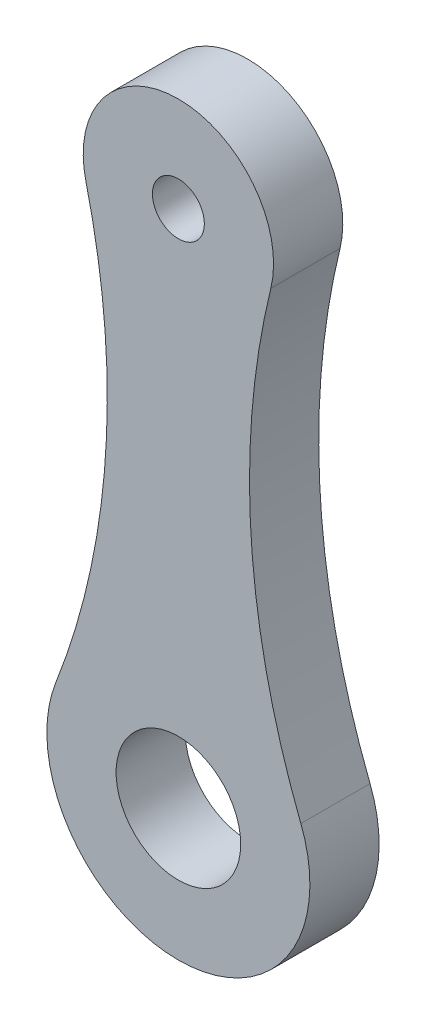
ISO-10303-21;
HEADER;
FILE_DESCRIPTION(('STEP AP214'),'2;1');
FILE_NAME('part.step','',(''),(''),'','','');
FILE_SCHEMA(('AUTOMOTIVE_DESIGN { 1 0 10303 214 1 1 1 1 }'));
ENDSEC;
DATA;
#1=APPLICATION_CONTEXT('core data for automotive mechanical design processes');
#2=APPLICATION_PROTOCOL_DEFINITION('international standard','automotive_design',2000,#1);
#3=PRODUCT_CONTEXT('',#1,'mechanical');
#4=PRODUCT('Part','Part','',(#3));
#5=PRODUCT_RELATED_PRODUCT_CATEGORY('part','',(#4));
#6=PRODUCT_DEFINITION_FORMATION('','',#4);
#7=PRODUCT_DEFINITION_CONTEXT('part definition',#1,'design');
#8=PRODUCT_DEFINITION('design','',#6,#7);
#9=PRODUCT_DEFINITION_SHAPE('','',#8);
#10=(LENGTH_UNIT() NAMED_UNIT(*) SI_UNIT(.MILLI.,.METRE.));
#11=(NAMED_UNIT(*) PLANE_ANGLE_UNIT() SI_UNIT($,.RADIAN.));
#12=(NAMED_UNIT(*) SI_UNIT($,.STERADIAN.) SOLID_ANGLE_UNIT());
#13=UNCERTAINTY_MEASURE_WITH_UNIT(LENGTH_MEASURE(1.E-05),#10,'distance_accuracy_value','');
#14=(GEOMETRIC_REPRESENTATION_CONTEXT(3) GLOBAL_UNCERTAINTY_ASSIGNED_CONTEXT((#13)) GLOBAL_UNIT_ASSIGNED_CONTEXT((#10,
#11,#12)) REPRESENTATION_CONTEXT('',''));
#15=CARTESIAN_POINT('',(0.,0.,0.));
#16=DIRECTION('',(0.,0.,1.));
#17=DIRECTION('',(1.,0.,0.));
#18=AXIS2_PLACEMENT_3D('',#15,#16,#17);
#19=CARTESIAN_POINT('',(47.1242404305022,3.46950748520222,4.));
#20=DIRECTION('',(0.,0.,-1.));
#21=DIRECTION('',(-1.,0.,0.));
#22=AXIS2_PLACEMENT_3D('',#19,#20,#21);
#23=CYLINDRICAL_SURFACE('',#22,43.0143926457458);
#24=CARTESIAN_POINT('',(47.1242404305022,3.46950748520222,0.));
#25=DIRECTION('',(0.,0.,1.));
#26=DIRECTION('',(1.,0.,0.));
#27=AXIS2_PLACEMENT_3D('',#24,#25,#26);
#28=CIRCLE('',#27,43.0143926457458);
#29=CARTESIAN_POINT('',(5.34240064098773,13.6928062916408,0.));
#30=VERTEX_POINT('',#29);
#31=CARTESIAN_POINT('',(7.07593647875019,-12.2267126097909,0.));
#32=VERTEX_POINT('',#31);
#33=EDGE_CURVE('E121',#30,#32,#28,.T.);
#34=ORIENTED_EDGE('',*,*,#33,.F.);
#35=DIRECTION('',(0.,0.,-1.));
#36=VECTOR('',#35,1.);
#37=CARTESIAN_POINT('',(5.34240064098773,13.6928062916408,4.));
#38=LINE('',#37,#36);
#39=CARTESIAN_POINT('',(5.34240064098773,13.6928062916408,4.));
#40=VERTEX_POINT('',#39);
#41=EDGE_CURVE('E11',#40,#30,#38,.T.);
#42=ORIENTED_EDGE('',*,*,#41,.F.);
#43=CARTESIAN_POINT('',(47.1242404305022,3.46950748520222,4.));
#44=DIRECTION('',(0.,0.,1.));
#45=DIRECTION('',(1.,0.,0.));
#46=AXIS2_PLACEMENT_3D('',#43,#44,#45);
#47=CIRCLE('',#46,43.0143926457458);
#48=CARTESIAN_POINT('',(7.07593647875019,-12.2267126097909,4.));
#49=VERTEX_POINT('',#48);
#50=EDGE_CURVE('E97',#40,#49,#47,.T.);
#51=ORIENTED_EDGE('',*,*,#50,.T.);
#52=DIRECTION('',(0.,0.,-1.));
#53=VECTOR('',#52,1.);
#54=CARTESIAN_POINT('',(7.07593647875019,-12.2267126097909,4.));
#55=LINE('',#54,#53);
#56=EDGE_CURVE('E85',#49,#32,#55,.T.);
#57=ORIENTED_EDGE('',*,*,#56,.T.);
#58=EDGE_LOOP('',(#34,#42,#51,#57));
#59=FACE_BOUND('',#58,.T.);
#60=ADVANCED_FACE('F45',(#59),#23,.F.);
#61=CARTESIAN_POINT('',(0.,15.,4.));
#62=DIRECTION('',(0.,0.,-1.));
#63=DIRECTION('',(-1.,0.,0.));
#64=AXIS2_PLACEMENT_3D('',#61,#62,#63);
#65=CYLINDRICAL_SURFACE('',#64,5.5);
#66=CARTESIAN_POINT('',(0.,15.,0.));
#67=DIRECTION('',(0.,0.,1.));
#68=DIRECTION('',(1.,0.,0.));
#69=AXIS2_PLACEMENT_3D('',#66,#67,#68);
#70=CIRCLE('',#69,5.5);
#71=CARTESIAN_POINT('',(-5.34240064098772,13.6928062916408,0.));
#72=VERTEX_POINT('',#71);
#73=EDGE_CURVE('E103',#30,#72,#70,.T.);
#74=ORIENTED_EDGE('',*,*,#73,.T.);
#75=DIRECTION('',(0.,0.,-1.));
#76=VECTOR('',#75,1.);
#77=CARTESIAN_POINT('',(-5.34240064098772,13.6928062916408,4.));
#78=LINE('',#77,#76);
#79=CARTESIAN_POINT('',(-5.34240064098772,13.6928062916408,4.));
#80=VERTEX_POINT('',#79);
#81=EDGE_CURVE('E54',#80,#72,#78,.T.);
#82=ORIENTED_EDGE('',*,*,#81,.F.);
#83=CARTESIAN_POINT('',(0.,15.,4.));
#84=DIRECTION('',(0.,0.,1.));
#85=DIRECTION('',(1.,0.,0.));
#86=AXIS2_PLACEMENT_3D('',#83,#84,#85);
#87=CIRCLE('',#86,5.5);
#88=EDGE_CURVE('E91',#40,#80,#87,.T.);
#89=ORIENTED_EDGE('',*,*,#88,.F.);
#90=ORIENTED_EDGE('',*,*,#41,.T.);
#91=EDGE_LOOP('',(#74,#82,#89,#90));
#92=FACE_BOUND('',#91,.T.);
#93=ADVANCED_FACE('F101',(#92),#65,.T.);
#94=CARTESIAN_POINT('',(-47.1242404305022,3.46950748520221,4.));
#95=DIRECTION('',(0.,0.,-1.));
#96=DIRECTION('',(-1.,0.,0.));
#97=AXIS2_PLACEMENT_3D('',#94,#95,#96);
#98=CYLINDRICAL_SURFACE('',#97,43.0143926457458);
#99=CARTESIAN_POINT('',(-47.1242404305022,3.46950748520221,0.));
#100=DIRECTION('',(0.,0.,1.));
#101=DIRECTION('',(1.,0.,0.));
#102=AXIS2_PLACEMENT_3D('',#99,#100,#101);
#103=CIRCLE('',#102,43.0143926457458);
#104=CARTESIAN_POINT('',(-7.07593647875018,-12.2267126097909,0.));
#105=VERTEX_POINT('',#104);
#106=EDGE_CURVE('E78',#72,#105,#103,.F.);
#107=ORIENTED_EDGE('',*,*,#106,.T.);
#108=DIRECTION('',(0.,0.,-1.));
#109=VECTOR('',#108,1.);
#110=CARTESIAN_POINT('',(-7.07593647875018,-12.2267126097909,4.));
#111=LINE('',#110,#109);
#112=CARTESIAN_POINT('',(-7.07593647875018,-12.2267126097909,4.));
#113=VERTEX_POINT('',#112);
#114=EDGE_CURVE('E105',#113,#105,#111,.T.);
#115=ORIENTED_EDGE('',*,*,#114,.F.);
#116=CARTESIAN_POINT('',(-47.1242404305022,3.46950748520221,4.));
#117=DIRECTION('',(0.,0.,1.));
#118=DIRECTION('',(1.,0.,0.));
#119=AXIS2_PLACEMENT_3D('',#116,#117,#118);
#120=CIRCLE('',#119,43.0143926457458);
#121=EDGE_CURVE('E96',#80,#113,#120,.F.);
#122=ORIENTED_EDGE('',*,*,#121,.F.);
#123=ORIENTED_EDGE('',*,*,#81,.T.);
#124=EDGE_LOOP('',(#107,#115,#122,#123));
#125=FACE_BOUND('',#124,.T.);
#126=ADVANCED_FACE('F106',(#125),#98,.F.);
#127=CARTESIAN_POINT('',(0.,15.,4.));
#128=DIRECTION('',(0.,0.,-1.));
#129=DIRECTION('',(-1.,0.,0.));
#130=AXIS2_PLACEMENT_3D('',#127,#128,#129);
#131=CYLINDRICAL_SURFACE('',#130,1.5);
#132=CARTESIAN_POINT('',(0.,15.,4.));
#133=DIRECTION('',(0.,0.,1.));
#134=DIRECTION('',(1.,0.,0.));
#135=AXIS2_PLACEMENT_3D('',#132,#133,#134);
#136=CIRCLE('',#135,1.5);
#137=CARTESIAN_POINT('',(1.50000000000001,15.,4.));
#138=VERTEX_POINT('',#137);
#139=EDGE_CURVE('E110',#138,#138,#136,.T.);
#140=ORIENTED_EDGE('',*,*,#139,.T.);
#141=EDGE_LOOP('',(#140));
#142=FACE_BOUND('',#141,.T.);
#143=CARTESIAN_POINT('',(0.,15.,0.));
#144=DIRECTION('',(0.,0.,1.));
#145=DIRECTION('',(1.,0.,0.));
#146=AXIS2_PLACEMENT_3D('',#143,#144,#145);
#147=CIRCLE('',#146,1.5);
#148=CARTESIAN_POINT('',(1.50000000000001,15.,0.));
#149=VERTEX_POINT('',#148);
#150=EDGE_CURVE('E132',#149,#149,#147,.T.);
#151=ORIENTED_EDGE('',*,*,#150,.F.);
#152=EDGE_LOOP('',(#151));
#153=FACE_BOUND('',#152,.T.);
#154=ADVANCED_FACE('F156',(#142,#153),#131,.F.);
#155=CARTESIAN_POINT('',(0.,-15.,4.));
#156=DIRECTION('',(0.,0.,-1.));
#157=DIRECTION('',(-1.,0.,0.));
#158=AXIS2_PLACEMENT_3D('',#155,#156,#157);
#159=CYLINDRICAL_SURFACE('',#158,7.60000000000001);
#160=CARTESIAN_POINT('',(0.,-15.,0.));
#161=DIRECTION('',(0.,0.,1.));
#162=DIRECTION('',(1.,0.,0.));
#163=AXIS2_PLACEMENT_3D('',#160,#161,#162);
#164=CIRCLE('',#163,7.60000000000001);
#165=EDGE_CURVE('E129',#105,#32,#164,.T.);
#166=ORIENTED_EDGE('',*,*,#165,.T.);
#167=ORIENTED_EDGE('',*,*,#56,.F.);
#168=CARTESIAN_POINT('',(0.,-15.,4.));
#169=DIRECTION('',(0.,0.,1.));
#170=DIRECTION('',(1.,0.,0.));
#171=AXIS2_PLACEMENT_3D('',#168,#169,#170);
#172=CIRCLE('',#171,7.60000000000001);
#173=EDGE_CURVE('E62',#113,#49,#172,.T.);
#174=ORIENTED_EDGE('',*,*,#173,.F.);
#175=ORIENTED_EDGE('',*,*,#114,.T.);
#176=EDGE_LOOP('',(#166,#167,#174,#175));
#177=FACE_BOUND('',#176,.T.);
#178=ADVANCED_FACE('F145',(#177),#159,.T.);
#179=CARTESIAN_POINT('',(0.,-15.,4.));
#180=DIRECTION('',(0.,0.,-1.));
#181=DIRECTION('',(-1.,0.,0.));
#182=AXIS2_PLACEMENT_3D('',#179,#180,#181);
#183=CYLINDRICAL_SURFACE('',#182,3.6);
#184=CARTESIAN_POINT('',(0.,-15.,4.));
#185=DIRECTION('',(0.,0.,1.));
#186=DIRECTION('',(1.,0.,0.));
#187=AXIS2_PLACEMENT_3D('',#184,#185,#186);
#188=CIRCLE('',#187,3.6);
#189=CARTESIAN_POINT('',(3.6,-15.,4.));
#190=VERTEX_POINT('',#189);
#191=EDGE_CURVE('E117',#190,#190,#188,.T.);
#192=ORIENTED_EDGE('',*,*,#191,.T.);
#193=EDGE_LOOP('',(#192));
#194=FACE_BOUND('',#193,.T.);
#195=CARTESIAN_POINT('',(0.,-15.,0.));
#196=DIRECTION('',(0.,0.,1.));
#197=DIRECTION('',(1.,0.,0.));
#198=AXIS2_PLACEMENT_3D('',#195,#196,#197);
#199=CIRCLE('',#198,3.6);
#200=CARTESIAN_POINT('',(3.6,-15.,0.));
#201=VERTEX_POINT('',#200);
#202=EDGE_CURVE('E136',#201,#201,#199,.T.);
#203=ORIENTED_EDGE('',*,*,#202,.F.);
#204=EDGE_LOOP('',(#203));
#205=FACE_BOUND('',#204,.T.);
#206=ADVANCED_FACE('F161',(#194,#205),#183,.F.);
#207=CARTESIAN_POINT('',(0.,0.,4.));
#208=DIRECTION('',(0.,0.,1.));
#209=DIRECTION('',(1.,0.,0.));
#210=AXIS2_PLACEMENT_3D('',#207,#208,#209);
#211=PLANE('',#210);
#212=ORIENTED_EDGE('',*,*,#50,.F.);
#213=ORIENTED_EDGE('',*,*,#88,.T.);
#214=ORIENTED_EDGE('',*,*,#121,.T.);
#215=ORIENTED_EDGE('',*,*,#173,.T.);
#216=EDGE_LOOP('',(#212,#213,#214,#215));
#217=FACE_BOUND('',#216,.T.);
#218=ORIENTED_EDGE('',*,*,#139,.F.);
#219=EDGE_LOOP('',(#218));
#220=FACE_BOUND('',#219,.T.);
#221=ORIENTED_EDGE('',*,*,#191,.F.);
#222=EDGE_LOOP('',(#221));
#223=FACE_BOUND('',#222,.T.);
#224=ADVANCED_FACE('F93',(#217,#220,#223),#211,.T.);
#225=CARTESIAN_POINT('',(0.,0.,0.));
#226=DIRECTION('',(0.,0.,1.));
#227=DIRECTION('',(1.,0.,0.));
#228=AXIS2_PLACEMENT_3D('',#225,#226,#227);
#229=PLANE('',#228);
#230=ORIENTED_EDGE('',*,*,#33,.T.);
#231=ORIENTED_EDGE('',*,*,#165,.F.);
#232=ORIENTED_EDGE('',*,*,#106,.F.);
#233=ORIENTED_EDGE('',*,*,#73,.F.);
#234=EDGE_LOOP('',(#230,#231,#232,#233));
#235=FACE_BOUND('',#234,.T.);
#236=ORIENTED_EDGE('',*,*,#150,.T.);
#237=EDGE_LOOP('',(#236));
#238=FACE_BOUND('',#237,.T.);
#239=ORIENTED_EDGE('',*,*,#202,.T.);
#240=EDGE_LOOP('',(#239));
#241=FACE_BOUND('',#240,.T.);
#242=ADVANCED_FACE('F147',(#235,#238,#241),#229,.F.);
#243=CLOSED_SHELL('',(#60,#93,#126,#154,#178,#206,#224,#242));
#244=MANIFOLD_SOLID_BREP('B2',#243);
#245=ADVANCED_BREP_SHAPE_REPRESENTATION('',(#18,#244),#14);
#246=SHAPE_DEFINITION_REPRESENTATION(#9,#245);
ENDSEC;
END-ISO-10303-21;
